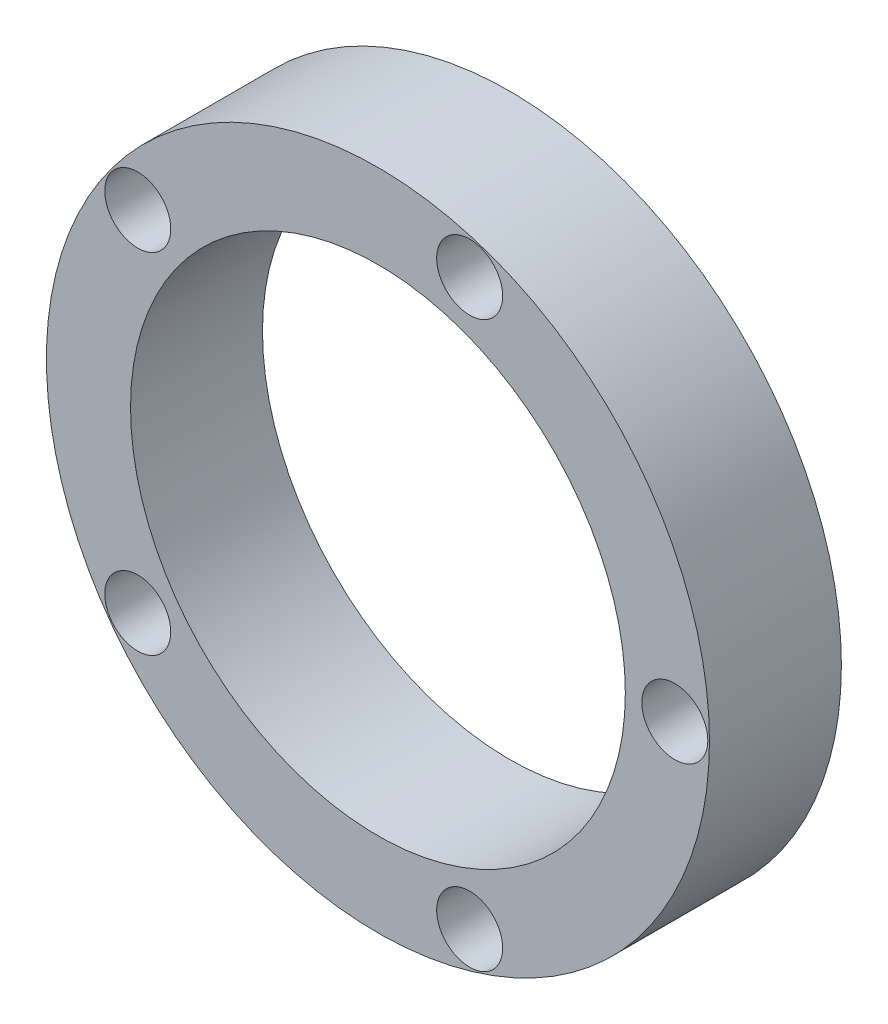
ISO-10303-21;
HEADER;
FILE_DESCRIPTION(('STEP AP214'),'2;1');
FILE_NAME('part.step','',(''),(''),'','','');
FILE_SCHEMA(('AUTOMOTIVE_DESIGN { 1 0 10303 214 1 1 1 1 }'));
ENDSEC;
DATA;
#1=APPLICATION_CONTEXT('core data for automotive mechanical design processes');
#2=APPLICATION_PROTOCOL_DEFINITION('international standard','automotive_design',2000,#1);
#3=PRODUCT_CONTEXT('',#1,'mechanical');
#4=PRODUCT('Part','Part','',(#3));
#5=PRODUCT_RELATED_PRODUCT_CATEGORY('part','',(#4));
#6=PRODUCT_DEFINITION_FORMATION('','',#4);
#7=PRODUCT_DEFINITION_CONTEXT('part definition',#1,'design');
#8=PRODUCT_DEFINITION('design','',#6,#7);
#9=PRODUCT_DEFINITION_SHAPE('','',#8);
#10=(LENGTH_UNIT() NAMED_UNIT(*) SI_UNIT(.MILLI.,.METRE.));
#11=(NAMED_UNIT(*) PLANE_ANGLE_UNIT() SI_UNIT($,.RADIAN.));
#12=(NAMED_UNIT(*) SI_UNIT($,.STERADIAN.) SOLID_ANGLE_UNIT());
#13=UNCERTAINTY_MEASURE_WITH_UNIT(LENGTH_MEASURE(1.E-05),#10,'distance_accuracy_value','');
#14=(GEOMETRIC_REPRESENTATION_CONTEXT(3) GLOBAL_UNCERTAINTY_ASSIGNED_CONTEXT((#13)) GLOBAL_UNIT_ASSIGNED_CONTEXT((#10,
#11,#12)) REPRESENTATION_CONTEXT('',''));
#15=CARTESIAN_POINT('',(0.,0.,0.));
#16=DIRECTION('',(0.,0.,1.));
#17=DIRECTION('',(1.,0.,0.));
#18=AXIS2_PLACEMENT_3D('',#15,#16,#17);
#19=CARTESIAN_POINT('',(0.,0.,0.));
#20=DIRECTION('',(0.,0.,1.));
#21=DIRECTION('',(1.,0.,0.));
#22=AXIS2_PLACEMENT_3D('',#19,#20,#21);
#23=PLANE('',#22);
#24=CARTESIAN_POINT('',(9.,0.,0.));
#25=DIRECTION('',(0.,0.,1.));
#26=DIRECTION('',(1.,0.,0.));
#27=AXIS2_PLACEMENT_3D('',#24,#25,#26);
#28=CIRCLE('',#27,1.);
#29=CARTESIAN_POINT('',(10.,0.,0.));
#30=VERTEX_POINT('',#29);
#31=EDGE_CURVE('E64',#30,#30,#28,.T.);
#32=ORIENTED_EDGE('',*,*,#31,.T.);
#33=EDGE_LOOP('',(#32));
#34=FACE_BOUND('',#33,.T.);
#35=CARTESIAN_POINT('',(2.7811529493745,-8.55950864665639,0.));
#36=DIRECTION('',(0.,0.,1.));
#37=DIRECTION('',(1.,0.,0.));
#38=AXIS2_PLACEMENT_3D('',#35,#36,#37);
#39=CIRCLE('',#38,0.999999999999999);
#40=CARTESIAN_POINT('',(3.7811529493745,-8.55950864665639,0.));
#41=VERTEX_POINT('',#40);
#42=EDGE_CURVE('E50',#41,#41,#39,.T.);
#43=ORIENTED_EDGE('',*,*,#42,.T.);
#44=EDGE_LOOP('',(#43));
#45=FACE_BOUND('',#44,.T.);
#46=CARTESIAN_POINT('',(-7.28115294937456,-5.29006727063222,0.));
#47=DIRECTION('',(0.,0.,1.));
#48=DIRECTION('',(1.,0.,0.));
#49=AXIS2_PLACEMENT_3D('',#46,#47,#48);
#50=CIRCLE('',#49,1.);
#51=CARTESIAN_POINT('',(-6.28115294937456,-5.29006727063222,0.));
#52=VERTEX_POINT('',#51);
#53=EDGE_CURVE('E58',#52,#52,#50,.T.);
#54=ORIENTED_EDGE('',*,*,#53,.T.);
#55=EDGE_LOOP('',(#54));
#56=FACE_BOUND('',#55,.T.);
#57=CARTESIAN_POINT('',(-7.28115294937448,5.29006727063232,0.));
#58=DIRECTION('',(0.,0.,1.));
#59=DIRECTION('',(1.,0.,0.));
#60=AXIS2_PLACEMENT_3D('',#57,#58,#59);
#61=CIRCLE('',#60,1.);
#62=CARTESIAN_POINT('',(-6.28115294937448,5.29006727063232,0.));
#63=VERTEX_POINT('',#62);
#64=EDGE_CURVE('E72',#63,#63,#61,.T.);
#65=ORIENTED_EDGE('',*,*,#64,.T.);
#66=EDGE_LOOP('',(#65));
#67=FACE_BOUND('',#66,.T.);
#68=CARTESIAN_POINT('',(2.78115294937462,8.55950864665635,0.));
#69=DIRECTION('',(0.,0.,1.));
#70=DIRECTION('',(1.,0.,0.));
#71=AXIS2_PLACEMENT_3D('',#68,#69,#70);
#72=CIRCLE('',#71,1.);
#73=CARTESIAN_POINT('',(3.78115294937463,8.55950864665635,0.));
#74=VERTEX_POINT('',#73);
#75=EDGE_CURVE('E68',#74,#74,#72,.T.);
#76=ORIENTED_EDGE('',*,*,#75,.T.);
#77=EDGE_LOOP('',(#76));
#78=FACE_BOUND('',#77,.T.);
#79=CARTESIAN_POINT('',(0.,0.,0.));
#80=DIRECTION('',(0.,0.,-1.));
#81=DIRECTION('',(-1.,0.,0.));
#82=AXIS2_PLACEMENT_3D('',#79,#80,#81);
#83=CIRCLE('',#82,7.5);
#84=CARTESIAN_POINT('',(-7.5,0.,0.));
#85=VERTEX_POINT('',#84);
#86=EDGE_CURVE('E44',#85,#85,#83,.T.);
#87=ORIENTED_EDGE('',*,*,#86,.F.);
#88=EDGE_LOOP('',(#87));
#89=FACE_BOUND('',#88,.T.);
#90=CARTESIAN_POINT('',(0.,0.,0.));
#91=DIRECTION('',(0.,0.,1.));
#92=DIRECTION('',(1.,0.,0.));
#93=AXIS2_PLACEMENT_3D('',#90,#91,#92);
#94=CIRCLE('',#93,10.05);
#95=CARTESIAN_POINT('',(10.05,0.,0.));
#96=VERTEX_POINT('',#95);
#97=EDGE_CURVE('E59',#96,#96,#94,.T.);
#98=ORIENTED_EDGE('',*,*,#97,.F.);
#99=EDGE_LOOP('',(#98));
#100=FACE_BOUND('',#99,.T.);
#101=ADVANCED_FACE('F36',(#34,#45,#56,#67,#78,#89,#100),#23,.F.);
#102=CARTESIAN_POINT('',(0.,0.,4.));
#103=DIRECTION('',(0.,0.,1.));
#104=DIRECTION('',(1.,0.,0.));
#105=AXIS2_PLACEMENT_3D('',#102,#103,#104);
#106=PLANE('',#105);
#107=CARTESIAN_POINT('',(0.,0.,4.));
#108=DIRECTION('',(0.,0.,1.));
#109=DIRECTION('',(1.,0.,0.));
#110=AXIS2_PLACEMENT_3D('',#107,#108,#109);
#111=CIRCLE('',#110,7.5);
#112=CARTESIAN_POINT('',(7.5,0.,4.));
#113=VERTEX_POINT('',#112);
#114=EDGE_CURVE('E10',#113,#113,#111,.F.);
#115=ORIENTED_EDGE('',*,*,#114,.T.);
#116=EDGE_LOOP('',(#115));
#117=FACE_BOUND('',#116,.T.);
#118=CARTESIAN_POINT('',(-7.28115294937456,-5.29006727063222,4.));
#119=DIRECTION('',(0.,0.,1.));
#120=DIRECTION('',(1.,0.,0.));
#121=AXIS2_PLACEMENT_3D('',#118,#119,#120);
#122=CIRCLE('',#121,1.);
#123=CARTESIAN_POINT('',(-6.28115294937456,-5.29006727063222,4.));
#124=VERTEX_POINT('',#123);
#125=EDGE_CURVE('E54',#124,#124,#122,.T.);
#126=ORIENTED_EDGE('',*,*,#125,.F.);
#127=EDGE_LOOP('',(#126));
#128=FACE_BOUND('',#127,.T.);
#129=CARTESIAN_POINT('',(9.,0.,4.));
#130=DIRECTION('',(0.,0.,1.));
#131=DIRECTION('',(1.,0.,0.));
#132=AXIS2_PLACEMENT_3D('',#129,#130,#131);
#133=CIRCLE('',#132,1.);
#134=CARTESIAN_POINT('',(10.,0.,4.));
#135=VERTEX_POINT('',#134);
#136=EDGE_CURVE('E60',#135,#135,#133,.T.);
#137=ORIENTED_EDGE('',*,*,#136,.F.);
#138=EDGE_LOOP('',(#137));
#139=FACE_BOUND('',#138,.T.);
#140=CARTESIAN_POINT('',(2.78115294937462,8.55950864665635,4.));
#141=DIRECTION('',(0.,0.,1.));
#142=DIRECTION('',(1.,0.,0.));
#143=AXIS2_PLACEMENT_3D('',#140,#141,#142);
#144=CIRCLE('',#143,1.);
#145=CARTESIAN_POINT('',(3.78115294937463,8.55950864665635,4.));
#146=VERTEX_POINT('',#145);
#147=EDGE_CURVE('E65',#146,#146,#144,.T.);
#148=ORIENTED_EDGE('',*,*,#147,.F.);
#149=EDGE_LOOP('',(#148));
#150=FACE_BOUND('',#149,.T.);
#151=CARTESIAN_POINT('',(-7.28115294937448,5.29006727063232,4.));
#152=DIRECTION('',(0.,0.,1.));
#153=DIRECTION('',(1.,0.,0.));
#154=AXIS2_PLACEMENT_3D('',#151,#152,#153);
#155=CIRCLE('',#154,1.);
#156=CARTESIAN_POINT('',(-6.28115294937448,5.29006727063232,4.));
#157=VERTEX_POINT('',#156);
#158=EDGE_CURVE('E69',#157,#157,#155,.T.);
#159=ORIENTED_EDGE('',*,*,#158,.F.);
#160=EDGE_LOOP('',(#159));
#161=FACE_BOUND('',#160,.T.);
#162=CARTESIAN_POINT('',(2.7811529493745,-8.55950864665639,4.));
#163=DIRECTION('',(0.,0.,1.));
#164=DIRECTION('',(1.,0.,0.));
#165=AXIS2_PLACEMENT_3D('',#162,#163,#164);
#166=CIRCLE('',#165,0.999999999999999);
#167=CARTESIAN_POINT('',(3.7811529493745,-8.55950864665639,4.));
#168=VERTEX_POINT('',#167);
#169=EDGE_CURVE('E39',#168,#168,#166,.T.);
#170=ORIENTED_EDGE('',*,*,#169,.F.);
#171=EDGE_LOOP('',(#170));
#172=FACE_BOUND('',#171,.T.);
#173=CARTESIAN_POINT('',(0.,0.,4.));
#174=DIRECTION('',(0.,0.,1.));
#175=DIRECTION('',(1.,0.,0.));
#176=AXIS2_PLACEMENT_3D('',#173,#174,#175);
#177=CIRCLE('',#176,10.05);
#178=CARTESIAN_POINT('',(10.05,0.,4.));
#179=VERTEX_POINT('',#178);
#180=EDGE_CURVE('E102',#179,#179,#177,.T.);
#181=ORIENTED_EDGE('',*,*,#180,.T.);
#182=EDGE_LOOP('',(#181));
#183=FACE_BOUND('',#182,.T.);
#184=ADVANCED_FACE('F96',(#117,#128,#139,#150,#161,#172,#183),#106,.T.);
#185=CARTESIAN_POINT('',(0.,0.,25.2132034355964));
#186=DIRECTION('',(0.,0.,-1.));
#187=DIRECTION('',(-1.,0.,0.));
#188=AXIS2_PLACEMENT_3D('',#185,#186,#187);
#189=CYLINDRICAL_SURFACE('',#188,7.5);
#190=ORIENTED_EDGE('',*,*,#86,.T.);
#191=EDGE_LOOP('',(#190));
#192=FACE_BOUND('',#191,.T.);
#193=ORIENTED_EDGE('',*,*,#114,.F.);
#194=EDGE_LOOP('',(#193));
#195=FACE_BOUND('',#194,.T.);
#196=ADVANCED_FACE('F99',(#192,#195),#189,.F.);
#197=CARTESIAN_POINT('',(-7.28115294937456,-5.29006727063222,10.));
#198=DIRECTION('',(0.,0.,-1.));
#199=DIRECTION('',(-1.,0.,0.));
#200=AXIS2_PLACEMENT_3D('',#197,#198,#199);
#201=CYLINDRICAL_SURFACE('',#200,1.);
#202=ORIENTED_EDGE('',*,*,#125,.T.);
#203=EDGE_LOOP('',(#202));
#204=FACE_BOUND('',#203,.T.);
#205=ORIENTED_EDGE('',*,*,#53,.F.);
#206=EDGE_LOOP('',(#205));
#207=FACE_BOUND('',#206,.T.);
#208=ADVANCED_FACE('F115',(#204,#207),#201,.F.);
#209=CARTESIAN_POINT('',(9.,0.,10.));
#210=DIRECTION('',(0.,0.,-1.));
#211=DIRECTION('',(-1.,0.,0.));
#212=AXIS2_PLACEMENT_3D('',#209,#210,#211);
#213=CYLINDRICAL_SURFACE('',#212,1.);
#214=ORIENTED_EDGE('',*,*,#136,.T.);
#215=EDGE_LOOP('',(#214));
#216=FACE_BOUND('',#215,.T.);
#217=ORIENTED_EDGE('',*,*,#31,.F.);
#218=EDGE_LOOP('',(#217));
#219=FACE_BOUND('',#218,.T.);
#220=ADVANCED_FACE('F117',(#216,#219),#213,.F.);
#221=CARTESIAN_POINT('',(2.78115294937462,8.55950864665635,10.));
#222=DIRECTION('',(0.,0.,-1.));
#223=DIRECTION('',(-1.,0.,0.));
#224=AXIS2_PLACEMENT_3D('',#221,#222,#223);
#225=CYLINDRICAL_SURFACE('',#224,1.);
#226=ORIENTED_EDGE('',*,*,#147,.T.);
#227=EDGE_LOOP('',(#226));
#228=FACE_BOUND('',#227,.T.);
#229=ORIENTED_EDGE('',*,*,#75,.F.);
#230=EDGE_LOOP('',(#229));
#231=FACE_BOUND('',#230,.T.);
#232=ADVANCED_FACE('F124',(#228,#231),#225,.F.);
#233=CARTESIAN_POINT('',(-7.28115294937448,5.29006727063232,10.));
#234=DIRECTION('',(0.,0.,-1.));
#235=DIRECTION('',(-1.,0.,0.));
#236=AXIS2_PLACEMENT_3D('',#233,#234,#235);
#237=CYLINDRICAL_SURFACE('',#236,1.);
#238=ORIENTED_EDGE('',*,*,#158,.T.);
#239=EDGE_LOOP('',(#238));
#240=FACE_BOUND('',#239,.T.);
#241=ORIENTED_EDGE('',*,*,#64,.F.);
#242=EDGE_LOOP('',(#241));
#243=FACE_BOUND('',#242,.T.);
#244=ADVANCED_FACE('F163',(#240,#243),#237,.F.);
#245=CARTESIAN_POINT('',(2.7811529493745,-8.55950864665639,10.));
#246=DIRECTION('',(0.,0.,-1.));
#247=DIRECTION('',(-1.,0.,0.));
#248=AXIS2_PLACEMENT_3D('',#245,#246,#247);
#249=CYLINDRICAL_SURFACE('',#248,0.999999999999999);
#250=ORIENTED_EDGE('',*,*,#169,.T.);
#251=EDGE_LOOP('',(#250));
#252=FACE_BOUND('',#251,.T.);
#253=ORIENTED_EDGE('',*,*,#42,.F.);
#254=EDGE_LOOP('',(#253));
#255=FACE_BOUND('',#254,.T.);
#256=ADVANCED_FACE('F93',(#252,#255),#249,.F.);
#257=CARTESIAN_POINT('',(0.,0.,-6.));
#258=DIRECTION('',(0.,0.,1.));
#259=DIRECTION('',(1.,0.,0.));
#260=AXIS2_PLACEMENT_3D('',#257,#258,#259);
#261=CYLINDRICAL_SURFACE('',#260,10.05);
#262=ORIENTED_EDGE('',*,*,#180,.F.);
#263=EDGE_LOOP('',(#262));
#264=FACE_BOUND('',#263,.T.);
#265=ORIENTED_EDGE('',*,*,#97,.T.);
#266=EDGE_LOOP('',(#265));
#267=FACE_BOUND('',#266,.T.);
#268=ADVANCED_FACE('F152',(#264,#267),#261,.T.);
#269=CLOSED_SHELL('',(#101,#184,#196,#208,#220,#232,#244,#256,#268));
#270=MANIFOLD_SOLID_BREP('B2',#269);
#271=ADVANCED_BREP_SHAPE_REPRESENTATION('',(#18,#270),#14);
#272=SHAPE_DEFINITION_REPRESENTATION(#9,#271);
ENDSEC;
END-ISO-10303-21;
